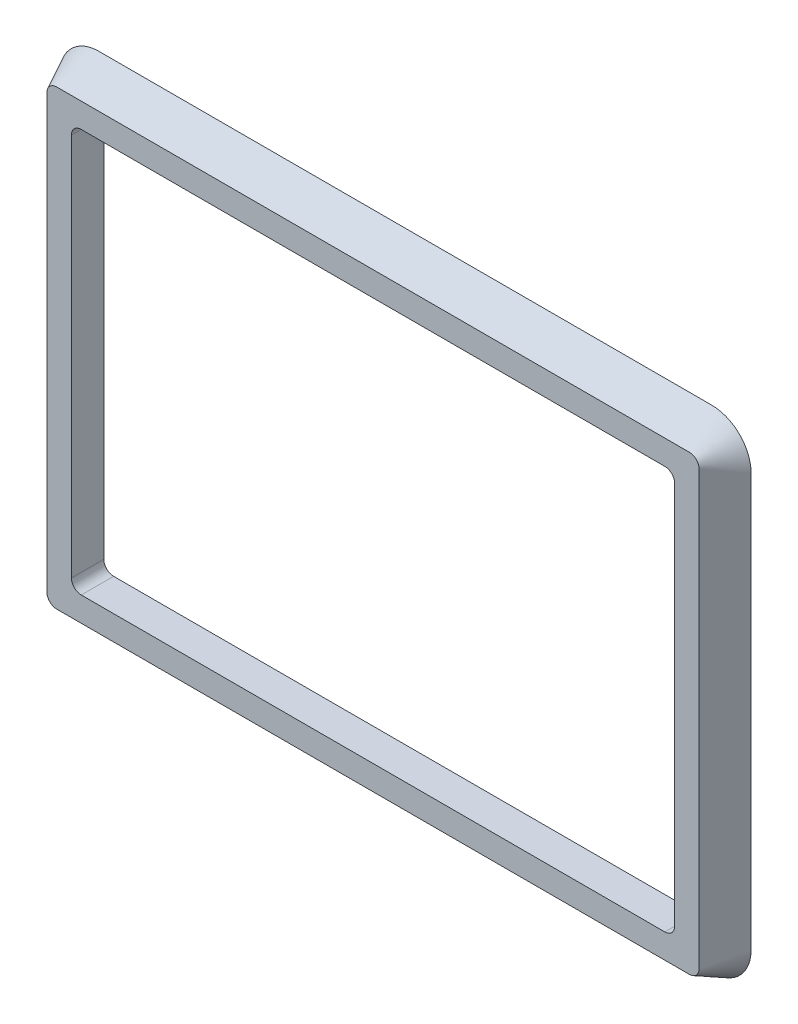
ISO-10303-21;
HEADER;
FILE_DESCRIPTION(('STEP AP214'),'2;1');
FILE_NAME('part.step','',(''),(''),'','','');
FILE_SCHEMA(('AUTOMOTIVE_DESIGN { 1 0 10303 214 1 1 1 1 }'));
ENDSEC;
DATA;
#1=APPLICATION_CONTEXT('core data for automotive mechanical design processes');
#2=APPLICATION_PROTOCOL_DEFINITION('international standard','automotive_design',2000,#1);
#3=PRODUCT_CONTEXT('',#1,'mechanical');
#4=PRODUCT('Part','Part','',(#3));
#5=PRODUCT_RELATED_PRODUCT_CATEGORY('part','',(#4));
#6=PRODUCT_DEFINITION_FORMATION('','',#4);
#7=PRODUCT_DEFINITION_CONTEXT('part definition',#1,'design');
#8=PRODUCT_DEFINITION('design','',#6,#7);
#9=PRODUCT_DEFINITION_SHAPE('','',#8);
#10=(LENGTH_UNIT() NAMED_UNIT(*) SI_UNIT(.MILLI.,.METRE.));
#11=(NAMED_UNIT(*) PLANE_ANGLE_UNIT() SI_UNIT($,.RADIAN.));
#12=(NAMED_UNIT(*) SI_UNIT($,.STERADIAN.) SOLID_ANGLE_UNIT());
#13=UNCERTAINTY_MEASURE_WITH_UNIT(LENGTH_MEASURE(1.E-05),#10,'distance_accuracy_value','');
#14=(GEOMETRIC_REPRESENTATION_CONTEXT(3) GLOBAL_UNCERTAINTY_ASSIGNED_CONTEXT((#13)) GLOBAL_UNIT_ASSIGNED_CONTEXT((#10,
#11,#12)) REPRESENTATION_CONTEXT('',''));
#15=CARTESIAN_POINT('',(0.,0.,0.));
#16=DIRECTION('',(0.,0.,1.));
#17=DIRECTION('',(1.,0.,0.));
#18=AXIS2_PLACEMENT_3D('',#15,#16,#17);
#19=CARTESIAN_POINT('',(-32.255,22.055,3.3));
#20=DIRECTION('',(0.,0.,-1.));
#21=DIRECTION('',(-1.,0.,0.));
#22=AXIS2_PLACEMENT_3D('',#19,#20,#21);
#23=PLANE('',#22);
#24=DIRECTION('',(-1.,0.,0.));
#25=VECTOR('',#24,1.);
#26=CARTESIAN_POINT('',(29.755,20.555,3.3));
#27=LINE('',#26,#25);
#28=CARTESIAN_POINT('',(29.755,20.555,3.3));
#29=VERTEX_POINT('',#28);
#30=CARTESIAN_POINT('',(-29.755,20.555,3.3));
#31=VERTEX_POINT('',#30);
#32=EDGE_CURVE('E351',#29,#31,#27,.T.);
#33=ORIENTED_EDGE('',*,*,#32,.F.);
#34=CARTESIAN_POINT('',(29.755,19.555,3.3));
#35=DIRECTION('',(0.,0.,1.));
#36=DIRECTION('',(-1.,0.,0.));
#37=AXIS2_PLACEMENT_3D('',#34,#35,#36);
#38=CIRCLE('',#37,1.);
#39=CARTESIAN_POINT('',(30.755,19.555,3.3));
#40=VERTEX_POINT('',#39);
#41=EDGE_CURVE('E241',#40,#29,#38,.T.);
#42=ORIENTED_EDGE('',*,*,#41,.F.);
#43=DIRECTION('',(0.,1.,0.));
#44=VECTOR('',#43,1.);
#45=CARTESIAN_POINT('',(30.755,-19.555,3.3));
#46=LINE('',#45,#44);
#47=CARTESIAN_POINT('',(30.755,-19.555,3.3));
#48=VERTEX_POINT('',#47);
#49=EDGE_CURVE('E372',#48,#40,#46,.T.);
#50=ORIENTED_EDGE('',*,*,#49,.F.);
#51=CARTESIAN_POINT('',(29.755,-19.555,3.3));
#52=DIRECTION('',(0.,0.,1.));
#53=DIRECTION('',(1.,0.,0.));
#54=AXIS2_PLACEMENT_3D('',#51,#52,#53);
#55=CIRCLE('',#54,1.);
#56=CARTESIAN_POINT('',(29.755,-20.555,3.3));
#57=VERTEX_POINT('',#56);
#58=EDGE_CURVE('E369',#57,#48,#55,.T.);
#59=ORIENTED_EDGE('',*,*,#58,.F.);
#60=DIRECTION('',(1.,0.,0.));
#61=VECTOR('',#60,1.);
#62=CARTESIAN_POINT('',(-29.755,-20.555,3.3));
#63=LINE('',#62,#61);
#64=CARTESIAN_POINT('',(-29.755,-20.555,3.3));
#65=VERTEX_POINT('',#64);
#66=EDGE_CURVE('E366',#65,#57,#63,.T.);
#67=ORIENTED_EDGE('',*,*,#66,.F.);
#68=CARTESIAN_POINT('',(-29.755,-19.555,3.3));
#69=DIRECTION('',(0.,0.,1.));
#70=DIRECTION('',(1.,0.,0.));
#71=AXIS2_PLACEMENT_3D('',#68,#69,#70);
#72=CIRCLE('',#71,1.);
#73=CARTESIAN_POINT('',(-30.755,-19.555,3.3));
#74=VERTEX_POINT('',#73);
#75=EDGE_CURVE('E360',#74,#65,#72,.T.);
#76=ORIENTED_EDGE('',*,*,#75,.F.);
#77=DIRECTION('',(0.,-1.,0.));
#78=VECTOR('',#77,1.);
#79=CARTESIAN_POINT('',(-30.755,19.555,3.3));
#80=LINE('',#79,#78);
#81=CARTESIAN_POINT('',(-30.755,19.555,3.3));
#82=VERTEX_POINT('',#81);
#83=EDGE_CURVE('E358',#82,#74,#80,.T.);
#84=ORIENTED_EDGE('',*,*,#83,.F.);
#85=CARTESIAN_POINT('',(-29.755,19.555,3.3));
#86=DIRECTION('',(0.,0.,1.));
#87=DIRECTION('',(1.,0.,0.));
#88=AXIS2_PLACEMENT_3D('',#85,#86,#87);
#89=CIRCLE('',#88,1.);
#90=EDGE_CURVE('E342',#31,#82,#89,.T.);
#91=ORIENTED_EDGE('',*,*,#90,.F.);
#92=EDGE_LOOP('',(#33,#42,#50,#59,#67,#76,#84,#91));
#93=FACE_BOUND('',#92,.T.);
#94=CARTESIAN_POINT('',(-32.255,22.055,3.3));
#95=DIRECTION('',(0.,0.,1.));
#96=DIRECTION('',(-1.,0.,0.));
#97=AXIS2_PLACEMENT_3D('',#94,#95,#96);
#98=CIRCLE('',#97,1.);
#99=CARTESIAN_POINT('',(-32.255,23.055,3.3));
#100=VERTEX_POINT('',#99);
#101=CARTESIAN_POINT('',(-33.255,22.055,3.3));
#102=VERTEX_POINT('',#101);
#103=EDGE_CURVE('E377',#100,#102,#98,.T.);
#104=ORIENTED_EDGE('',*,*,#103,.T.);
#105=DIRECTION('',(0.,-1.,0.));
#106=VECTOR('',#105,1.);
#107=CARTESIAN_POINT('',(-33.255,-22.055,3.3));
#108=LINE('',#107,#106);
#109=CARTESIAN_POINT('',(-33.255,-22.055,3.3));
#110=VERTEX_POINT('',#109);
#111=EDGE_CURVE('E592',#102,#110,#108,.T.);
#112=ORIENTED_EDGE('',*,*,#111,.T.);
#113=CARTESIAN_POINT('',(-32.255,-22.055,3.3));
#114=DIRECTION('',(0.,0.,1.));
#115=DIRECTION('',(-1.,0.,0.));
#116=AXIS2_PLACEMENT_3D('',#113,#114,#115);
#117=CIRCLE('',#116,1.);
#118=CARTESIAN_POINT('',(-32.255,-23.055,3.3));
#119=VERTEX_POINT('',#118);
#120=EDGE_CURVE('E595',#110,#119,#117,.T.);
#121=ORIENTED_EDGE('',*,*,#120,.T.);
#122=DIRECTION('',(1.,0.,0.));
#123=VECTOR('',#122,1.);
#124=CARTESIAN_POINT('',(-32.255,-23.055,3.3));
#125=LINE('',#124,#123);
#126=CARTESIAN_POINT('',(32.255,-23.055,3.3));
#127=VERTEX_POINT('',#126);
#128=EDGE_CURVE('E613',#119,#127,#125,.T.);
#129=ORIENTED_EDGE('',*,*,#128,.T.);
#130=CARTESIAN_POINT('',(32.255,-22.055,3.3));
#131=DIRECTION('',(0.,0.,1.));
#132=DIRECTION('',(1.,0.,0.));
#133=AXIS2_PLACEMENT_3D('',#130,#131,#132);
#134=CIRCLE('',#133,1.);
#135=CARTESIAN_POINT('',(33.255,-22.055,3.3));
#136=VERTEX_POINT('',#135);
#137=EDGE_CURVE('E616',#127,#136,#134,.T.);
#138=ORIENTED_EDGE('',*,*,#137,.T.);
#139=DIRECTION('',(0.,1.,0.));
#140=VECTOR('',#139,1.);
#141=CARTESIAN_POINT('',(33.255,-22.055,3.3));
#142=LINE('',#141,#140);
#143=CARTESIAN_POINT('',(33.255,22.055,3.3));
#144=VERTEX_POINT('',#143);
#145=EDGE_CURVE('E634',#136,#144,#142,.T.);
#146=ORIENTED_EDGE('',*,*,#145,.T.);
#147=CARTESIAN_POINT('',(32.255,22.055,3.3));
#148=DIRECTION('',(0.,0.,1.));
#149=DIRECTION('',(-1.,0.,0.));
#150=AXIS2_PLACEMENT_3D('',#147,#148,#149);
#151=CIRCLE('',#150,1.);
#152=CARTESIAN_POINT('',(32.255,23.055,3.3));
#153=VERTEX_POINT('',#152);
#154=EDGE_CURVE('E637',#144,#153,#151,.T.);
#155=ORIENTED_EDGE('',*,*,#154,.T.);
#156=DIRECTION('',(-1.,0.,0.));
#157=VECTOR('',#156,1.);
#158=CARTESIAN_POINT('',(-32.255,23.055,3.3));
#159=LINE('',#158,#157);
#160=EDGE_CURVE('E654',#153,#100,#159,.T.);
#161=ORIENTED_EDGE('',*,*,#160,.T.);
#162=EDGE_LOOP('',(#104,#112,#121,#129,#138,#146,#155,#161));
#163=FACE_BOUND('',#162,.T.);
#164=ADVANCED_FACE('F226',(#93,#163),#23,.F.);
#165=CARTESIAN_POINT('',(31.25,-21.055,0.));
#166=DIRECTION('',(0.,0.,1.));
#167=DIRECTION('',(1.,0.,0.));
#168=AXIS2_PLACEMENT_3D('',#165,#166,#167);
#169=PLANE('',#168);
#170=DIRECTION('',(0.,1.,0.));
#171=VECTOR('',#170,1.);
#172=CARTESIAN_POINT('',(30.755,-21.055,0.));
#173=LINE('',#172,#171);
#174=CARTESIAN_POINT('',(30.755,-19.555,0.));
#175=VERTEX_POINT('',#174);
#176=CARTESIAN_POINT('',(30.755,19.555,0.));
#177=VERTEX_POINT('',#176);
#178=EDGE_CURVE('E234',#175,#177,#173,.T.);
#179=ORIENTED_EDGE('',*,*,#178,.T.);
#180=CARTESIAN_POINT('',(29.755,19.555,0.));
#181=DIRECTION('',(0.,0.,1.));
#182=DIRECTION('',(1.,0.,0.));
#183=AXIS2_PLACEMENT_3D('',#180,#181,#182);
#184=CIRCLE('',#183,1.);
#185=CARTESIAN_POINT('',(29.755,20.555,0.));
#186=VERTEX_POINT('',#185);
#187=EDGE_CURVE('E12',#177,#186,#184,.T.);
#188=ORIENTED_EDGE('',*,*,#187,.T.);
#189=DIRECTION('',(-1.,0.,0.));
#190=VECTOR('',#189,1.);
#191=CARTESIAN_POINT('',(31.25,20.555,0.));
#192=LINE('',#191,#190);
#193=CARTESIAN_POINT('',(-29.755,20.555,0.));
#194=VERTEX_POINT('',#193);
#195=EDGE_CURVE('E513',#186,#194,#192,.T.);
#196=ORIENTED_EDGE('',*,*,#195,.T.);
#197=CARTESIAN_POINT('',(-29.755,19.555,0.));
#198=DIRECTION('',(0.,0.,1.));
#199=DIRECTION('',(1.,0.,0.));
#200=AXIS2_PLACEMENT_3D('',#197,#198,#199);
#201=CIRCLE('',#200,1.);
#202=CARTESIAN_POINT('',(-30.755,19.555,0.));
#203=VERTEX_POINT('',#202);
#204=EDGE_CURVE('E345',#194,#203,#201,.T.);
#205=ORIENTED_EDGE('',*,*,#204,.T.);
#206=DIRECTION('',(0.,-1.,0.));
#207=VECTOR('',#206,1.);
#208=CARTESIAN_POINT('',(-30.755,-21.055,0.));
#209=LINE('',#208,#207);
#210=CARTESIAN_POINT('',(-30.755,-19.555,0.));
#211=VERTEX_POINT('',#210);
#212=EDGE_CURVE('E670',#203,#211,#209,.T.);
#213=ORIENTED_EDGE('',*,*,#212,.T.);
#214=CARTESIAN_POINT('',(-29.755,-19.555,0.));
#215=DIRECTION('',(0.,0.,1.));
#216=DIRECTION('',(1.,0.,0.));
#217=AXIS2_PLACEMENT_3D('',#214,#215,#216);
#218=CIRCLE('',#217,1.);
#219=CARTESIAN_POINT('',(-29.755,-20.555,0.));
#220=VERTEX_POINT('',#219);
#221=EDGE_CURVE('E673',#211,#220,#218,.T.);
#222=ORIENTED_EDGE('',*,*,#221,.T.);
#223=DIRECTION('',(1.,0.,0.));
#224=VECTOR('',#223,1.);
#225=CARTESIAN_POINT('',(31.25,-20.555,0.));
#226=LINE('',#225,#224);
#227=CARTESIAN_POINT('',(29.755,-20.555,0.));
#228=VERTEX_POINT('',#227);
#229=EDGE_CURVE('E676',#220,#228,#226,.T.);
#230=ORIENTED_EDGE('',*,*,#229,.T.);
#231=CARTESIAN_POINT('',(29.755,-19.555,0.));
#232=DIRECTION('',(0.,0.,1.));
#233=DIRECTION('',(1.,0.,0.));
#234=AXIS2_PLACEMENT_3D('',#231,#232,#233);
#235=CIRCLE('',#234,1.);
#236=EDGE_CURVE('E679',#228,#175,#235,.T.);
#237=ORIENTED_EDGE('',*,*,#236,.T.);
#238=EDGE_LOOP('',(#179,#188,#196,#205,#213,#222,#230,#237));
#239=FACE_BOUND('',#238,.T.);
#240=CARTESIAN_POINT('',(31.25,-21.055,0.));
#241=DIRECTION('',(0.,0.,1.));
#242=DIRECTION('',(1.,0.,0.));
#243=AXIS2_PLACEMENT_3D('',#240,#241,#242);
#244=CIRCLE('',#243,4.);
#245=CARTESIAN_POINT('',(31.25,-25.055,0.));
#246=VERTEX_POINT('',#245);
#247=CARTESIAN_POINT('',(35.25,-21.055,0.));
#248=VERTEX_POINT('',#247);
#249=EDGE_CURVE('E508',#246,#248,#244,.T.);
#250=ORIENTED_EDGE('',*,*,#249,.F.);
#251=DIRECTION('',(1.,0.,0.));
#252=VECTOR('',#251,1.);
#253=CARTESIAN_POINT('',(-31.25,-25.055,0.));
#254=LINE('',#253,#252);
#255=CARTESIAN_POINT('',(-31.25,-25.055,0.));
#256=VERTEX_POINT('',#255);
#257=EDGE_CURVE('E392',#256,#246,#254,.T.);
#258=ORIENTED_EDGE('',*,*,#257,.F.);
#259=CARTESIAN_POINT('',(-31.25,-21.055,0.));
#260=DIRECTION('',(0.,0.,1.));
#261=DIRECTION('',(-1.,0.,0.));
#262=AXIS2_PLACEMENT_3D('',#259,#260,#261);
#263=CIRCLE('',#262,4.);
#264=CARTESIAN_POINT('',(-35.25,-21.055,0.));
#265=VERTEX_POINT('',#264);
#266=EDGE_CURVE('E514',#265,#256,#263,.T.);
#267=ORIENTED_EDGE('',*,*,#266,.F.);
#268=DIRECTION('',(0.,-1.,0.));
#269=VECTOR('',#268,1.);
#270=CARTESIAN_POINT('',(-35.25,-21.055,0.));
#271=LINE('',#270,#269);
#272=CARTESIAN_POINT('',(-35.25,21.055,0.));
#273=VERTEX_POINT('',#272);
#274=EDGE_CURVE('E532',#273,#265,#271,.T.);
#275=ORIENTED_EDGE('',*,*,#274,.F.);
#276=CARTESIAN_POINT('',(-31.25,21.055,0.));
#277=DIRECTION('',(0.,0.,1.));
#278=DIRECTION('',(-1.,0.,0.));
#279=AXIS2_PLACEMENT_3D('',#276,#277,#278);
#280=CIRCLE('',#279,4.);
#281=CARTESIAN_POINT('',(-31.25,25.055,0.));
#282=VERTEX_POINT('',#281);
#283=EDGE_CURVE('E535',#282,#273,#280,.T.);
#284=ORIENTED_EDGE('',*,*,#283,.F.);
#285=DIRECTION('',(-1.,0.,0.));
#286=VECTOR('',#285,1.);
#287=CARTESIAN_POINT('',(-31.25,25.055,0.));
#288=LINE('',#287,#286);
#289=CARTESIAN_POINT('',(31.25,25.055,0.));
#290=VERTEX_POINT('',#289);
#291=EDGE_CURVE('E553',#290,#282,#288,.T.);
#292=ORIENTED_EDGE('',*,*,#291,.F.);
#293=CARTESIAN_POINT('',(31.25,21.055,0.));
#294=DIRECTION('',(0.,0.,1.));
#295=DIRECTION('',(-1.,0.,0.));
#296=AXIS2_PLACEMENT_3D('',#293,#294,#295);
#297=CIRCLE('',#296,4.);
#298=CARTESIAN_POINT('',(35.25,21.055,0.));
#299=VERTEX_POINT('',#298);
#300=EDGE_CURVE('E556',#299,#290,#297,.T.);
#301=ORIENTED_EDGE('',*,*,#300,.F.);
#302=DIRECTION('',(0.,1.,0.));
#303=VECTOR('',#302,1.);
#304=CARTESIAN_POINT('',(35.25,-21.055,0.));
#305=LINE('',#304,#303);
#306=EDGE_CURVE('E574',#248,#299,#305,.T.);
#307=ORIENTED_EDGE('',*,*,#306,.F.);
#308=EDGE_LOOP('',(#250,#258,#267,#275,#284,#292,#301,#307));
#309=FACE_BOUND('',#308,.T.);
#310=ADVANCED_FACE('F410',(#239,#309),#169,.F.);
#311=CARTESIAN_POINT('',(35.25,21.0549999994716,0.));
#312=CARTESIAN_POINT('',(33.255,22.0549999995012,3.3));
#313=CARTESIAN_POINT('',(33.2548910613206,22.0550546053555,3.30018019931927));
#314=CARTESIAN_POINT('',(35.25,21.1380333099801,0.));
#315=CARTESIAN_POINT('',(33.255,22.1333793771264,3.3));
#316=CARTESIAN_POINT('',(33.2548910613206,22.1334337288488,3.30018019931927));
#317=CARTESIAN_POINT('',(35.2450740401068,21.3129727486955,0.));
#318=CARTESIAN_POINT('',(33.2420402399805,22.2229177651005,3.3));
#319=CARTESIAN_POINT('',(33.2419308626086,22.2229674534255,3.30018019931927));
#320=CARTESIAN_POINT('',(35.2149616165085,21.6110370684901,0.));
#321=CARTESIAN_POINT('',(33.2166572008428,22.3390530192757,3.3));
#322=CARTESIAN_POINT('',(33.2165480817229,22.3390927732087,3.30018019931927));
#323=CARTESIAN_POINT('',(35.1541801050728,21.9537932554618,0.));
#324=CARTESIAN_POINT('',(33.1838856390283,22.4274118129235,3.3));
#325=CARTESIAN_POINT('',(33.1837780494157,22.4274376752695,3.30018019931927));
#326=CARTESIAN_POINT('',(35.0477719173209,22.3357039683169,0.));
#327=CARTESIAN_POINT('',(33.1475829170302,22.5094420045234,3.3));
#328=CARTESIAN_POINT('',(33.1474791555865,22.5094514916373,3.30018019931927));
#329=CARTESIAN_POINT('',(34.8807794647742,22.7512318657617,0.));
#330=CARTESIAN_POINT('',(33.1068510264534,22.5803547468844,3.3));
#331=CARTESIAN_POINT('',(33.1067541595755,22.5803454159933,3.30018019931927));
#332=CARTESIAN_POINT('',(34.6596292666324,23.1663627219293,0.));
#333=CARTESIAN_POINT('',(33.0627604572817,22.6464936286021,3.3));
#334=CARTESIAN_POINT('',(33.0626732588961,22.6464652407062,3.30018019931927));
#335=CARTESIAN_POINT('',(34.3907478420953,23.547082310953,0.));
#336=CARTESIAN_POINT('',(33.0147858782825,22.7064913724488,3.3));
#337=CARTESIAN_POINT('',(33.0147107427039,22.7064454712625,3.30018019931927));
#338=CARTESIAN_POINT('',(34.0800576063056,23.8927048968527,0.));
#339=CARTESIAN_POINT('',(32.9632487369511,22.7624584976147,3.30000000000001));
#340=CARTESIAN_POINT('',(32.9631877526486,22.7623967795445,3.30018019931927));
#341=CARTESIAN_POINT('',(33.7334809744059,24.2025447436482,0.));
#342=CARTESIAN_POINT('',(32.9073306796916,22.8140626766366,3.29999999999999));
#343=CARTESIAN_POINT('',(32.907285567049,22.8139868573871,3.30018019931926));
#344=CARTESIAN_POINT('',(33.3519585421631,24.4704557644377,0.));
#345=CARTESIAN_POINT('',(32.8473897746949,22.8621102270252,3.30000000000001));
#346=CARTESIAN_POINT('',(32.8473622222863,22.862022401943,3.30018019931928));
#347=CARTESIAN_POINT('',(32.9364309053437,24.6902918723194,0.));
#348=CARTESIAN_POINT('',(32.7812614369247,22.9062811480817,3.29999999999999));
#349=CARTESIAN_POINT('',(32.7812529637633,22.906183730652,3.30018019931926));
#350=CARTESIAN_POINT('',(32.5214400504139,24.8558205036737,0.));
#351=CARTESIAN_POINT('',(32.7104061068242,22.9471097880587,3.30000000000001));
#352=CARTESIAN_POINT('',(32.7104164254772,22.9470055612794,3.30018019931928));
#353=CARTESIAN_POINT('',(32.1415279638394,24.9608090948807,0.));
#354=CARTESIAN_POINT('',(32.6282969190666,22.9835063601379,3.29999999999999));
#355=CARTESIAN_POINT('',(32.6283234995013,22.9833983878328,3.30018019931926));
#356=CARTESIAN_POINT('',(31.8013967239928,25.0204990858531,0.));
#357=CARTESIAN_POINT('',(32.5400235760803,23.0164110305599,3.30000000000001));
#358=CARTESIAN_POINT('',(32.5400639094306,23.0163015956195,3.30018019931927));
#359=CARTESIAN_POINT('',(31.5057484092465,25.0501319165035,0.));
#360=CARTESIAN_POINT('',(32.423523405877,23.0418961582726,3.3));
#361=CARTESIAN_POINT('',(32.4235735217647,23.0417864968433,3.30018019931927));
#362=CARTESIAN_POINT('',(31.3323063959239,25.055,0.));
#363=CARTESIAN_POINT('',(32.334072700125,23.055,3.3));
#364=CARTESIAN_POINT('',(32.3341274024299,23.0548907882914,3.30018019931927));
#365=CARTESIAN_POINT('',(25.8472934769061,25.055,0.));
#366=CARTESIAN_POINT('',(27.0645577753253,23.055,3.3));
#367=CARTESIAN_POINT('',(27.0646242450822,23.0548907882913,3.30018019931927));
#368=CARTESIAN_POINT('',(15.3489403943726,25.055,0.));
#369=CARTESIAN_POINT('',(16.4203076439289,23.055,3.3));
#370=CARTESIAN_POINT('',(16.4203661468528,23.0548907882913,3.30018019931927));
#371=CARTESIAN_POINT('',(0.,25.055,0.));
#372=CARTESIAN_POINT('',(0.,23.055,3.3));
#373=CARTESIAN_POINT('',(0.,23.0548907882914,3.30018019931926));
#374=CARTESIAN_POINT('',(-15.3489403943726,25.055,0.));
#375=CARTESIAN_POINT('',(-16.4203076439289,23.055,3.3));
#376=CARTESIAN_POINT('',(-16.4203661468528,23.0548907882913,3.30018019931927));
#377=CARTESIAN_POINT('',(-25.8472934769061,25.055,0.));
#378=CARTESIAN_POINT('',(-27.0645577753253,23.055,3.3));
#379=CARTESIAN_POINT('',(-27.0646242450822,23.0548907882913,3.30018019931927));
#380=CARTESIAN_POINT('',(-31.3323063959239,25.055,0.));
#381=CARTESIAN_POINT('',(-32.334072700125,23.055,3.3));
#382=CARTESIAN_POINT('',(-32.3341274024299,23.0548907882914,3.30018019931927));
#383=CARTESIAN_POINT('',(-31.5057484092465,25.0501319165035,0.));
#384=CARTESIAN_POINT('',(-32.423523405877,23.0418961582726,3.3));
#385=CARTESIAN_POINT('',(-32.4235735217648,23.0417864968433,3.30018019931927));
#386=CARTESIAN_POINT('',(-31.8013967239927,25.0204990858531,0.));
#387=CARTESIAN_POINT('',(-32.5400235760802,23.0164110305599,3.3));
#388=CARTESIAN_POINT('',(-32.5400639094305,23.0163015956195,3.30018019931927));
#389=CARTESIAN_POINT('',(-32.1415279638394,24.9608090948807,0.));
#390=CARTESIAN_POINT('',(-32.6282969190666,22.9835063601379,3.3));
#391=CARTESIAN_POINT('',(-32.6283234995013,22.9833983878328,3.30018019931927));
#392=CARTESIAN_POINT('',(-32.5214400504139,24.8558205036737,0.));
#393=CARTESIAN_POINT('',(-32.7104061068243,22.9471097880587,3.3));
#394=CARTESIAN_POINT('',(-32.7104164254772,22.9470055612794,3.30018019931927));
#395=CARTESIAN_POINT('',(-32.9364309053438,24.6902918723194,0.));
#396=CARTESIAN_POINT('',(-32.7812614369247,22.9062811480817,3.3));
#397=CARTESIAN_POINT('',(-32.7812529637633,22.906183730652,3.30018019931927));
#398=CARTESIAN_POINT('',(-33.3519585421631,24.4704557644377,0.));
#399=CARTESIAN_POINT('',(-32.8473897746949,22.8621102270251,3.3));
#400=CARTESIAN_POINT('',(-32.8473622222863,22.862022401943,3.30018019931927));
#401=CARTESIAN_POINT('',(-33.733480974406,24.2025447436482,0.));
#402=CARTESIAN_POINT('',(-32.9073306796916,22.8140626766366,3.3));
#403=CARTESIAN_POINT('',(-32.907285567049,22.8139868573871,3.30018019931927));
#404=CARTESIAN_POINT('',(-34.0800576063056,23.8927048968527,0.));
#405=CARTESIAN_POINT('',(-32.9632487369511,22.7624584976147,3.3));
#406=CARTESIAN_POINT('',(-32.9631877526486,22.7623967795445,3.30018019931927));
#407=CARTESIAN_POINT('',(-34.3907478420953,23.547082310953,0.));
#408=CARTESIAN_POINT('',(-33.0147858782824,22.7064913724488,3.29999999999999));
#409=CARTESIAN_POINT('',(-33.0147107427039,22.7064454712624,3.30018019931926));
#410=CARTESIAN_POINT('',(-34.6596292666324,23.1663627219293,0.));
#411=CARTESIAN_POINT('',(-33.0627604572817,22.6464936286022,3.30000000000001));
#412=CARTESIAN_POINT('',(-33.0626732588961,22.6464652407062,3.30018019931927));
#413=CARTESIAN_POINT('',(-34.8807794647742,22.7512318657617,0.));
#414=CARTESIAN_POINT('',(-33.1068510264534,22.5803547468844,3.3));
#415=CARTESIAN_POINT('',(-33.1067541595755,22.5803454159933,3.30018019931926));
#416=CARTESIAN_POINT('',(-35.0477719173209,22.3357039683169,0.));
#417=CARTESIAN_POINT('',(-33.1475829170302,22.5094420045233,3.3));
#418=CARTESIAN_POINT('',(-33.1474791555864,22.5094514916372,3.30018019931927));
#419=CARTESIAN_POINT('',(-35.1541801050728,21.9537932554618,0.));
#420=CARTESIAN_POINT('',(-33.1838856390284,22.4274118129236,3.3));
#421=CARTESIAN_POINT('',(-33.1837780494158,22.4274376752695,3.30018019931927));
#422=CARTESIAN_POINT('',(-35.2149616165085,21.6110370684901,0.));
#423=CARTESIAN_POINT('',(-33.2166572008427,22.3390530192757,3.3));
#424=CARTESIAN_POINT('',(-33.2165480817229,22.3390927732086,3.30018019931927));
#425=CARTESIAN_POINT('',(-35.2450740401068,21.3129727486955,0.));
#426=CARTESIAN_POINT('',(-33.2420402399805,22.2229177651005,3.3));
#427=CARTESIAN_POINT('',(-33.2419308626086,22.2229674534255,3.30018019931927));
#428=CARTESIAN_POINT('',(-35.25,21.1380333099801,0.));
#429=CARTESIAN_POINT('',(-33.255,22.1333793771264,3.3));
#430=CARTESIAN_POINT('',(-33.2548910613206,22.1334337288488,3.30018019931927));
#431=CARTESIAN_POINT('',(-35.25,17.3543677998165,0.));
#432=CARTESIAN_POINT('',(-33.255,18.5617844833128,3.3));
#433=CARTESIAN_POINT('',(-33.2548910613206,18.5618504153323,3.30018019931927));
#434=CARTESIAN_POINT('',(-35.2500000000001,10.2622451288133,0.));
#435=CARTESIAN_POINT('',(-33.255,11.3226655772709,3.3));
#436=CARTESIAN_POINT('',(-33.2548910613207,11.3227234824354,3.30018019931927));
#437=CARTESIAN_POINT('',(-35.2499999999999,0.,0.));
#438=CARTESIAN_POINT('',(-33.2549999999999,0.,3.3));
#439=CARTESIAN_POINT('',(-33.2548910613206,0.,3.30018019931927));
#440=CARTESIAN_POINT('',(-35.25,-10.2622451288133,0.));
#441=CARTESIAN_POINT('',(-33.255,-11.3226655772708,3.3));
#442=CARTESIAN_POINT('',(-33.2548910613207,-11.3227234824354,3.30018019931927));
#443=CARTESIAN_POINT('',(-35.25,-17.3543677998165,0.));
#444=CARTESIAN_POINT('',(-33.255,-18.5617844833128,3.3));
#445=CARTESIAN_POINT('',(-33.2548910613206,-18.5618504153323,3.30018019931927));
#446=CARTESIAN_POINT('',(-35.25,-21.1380333099801,0.));
#447=CARTESIAN_POINT('',(-33.255,-22.1333793771264,3.3));
#448=CARTESIAN_POINT('',(-33.2548910613206,-22.1334337288488,3.30018019931927));
#449=CARTESIAN_POINT('',(-35.2450740401068,-21.3129727486956,0.));
#450=CARTESIAN_POINT('',(-33.2420402399805,-22.2229177651005,3.3));
#451=CARTESIAN_POINT('',(-33.2419308626086,-22.2229674534255,3.30018019931927));
#452=CARTESIAN_POINT('',(-35.2149616165085,-21.6110370684901,0.));
#453=CARTESIAN_POINT('',(-33.2166572008428,-22.3390530192757,3.29999999999999));
#454=CARTESIAN_POINT('',(-33.2165480817229,-22.3390927732087,3.30018019931926));
#455=CARTESIAN_POINT('',(-35.1541801050728,-21.9537932554618,0.));
#456=CARTESIAN_POINT('',(-33.1838856390283,-22.4274118129236,3.30000000000001));
#457=CARTESIAN_POINT('',(-33.1837780494157,-22.4274376752695,3.30018019931928));
#458=CARTESIAN_POINT('',(-35.0477719173209,-22.3357039683169,0.));
#459=CARTESIAN_POINT('',(-33.1475829170302,-22.5094420045233,3.29999999999999));
#460=CARTESIAN_POINT('',(-33.1474791555865,-22.5094514916372,3.30018019931926));
#461=CARTESIAN_POINT('',(-34.8807794647742,-22.7512318657617,0.));
#462=CARTESIAN_POINT('',(-33.1068510264533,-22.5803547468844,3.3));
#463=CARTESIAN_POINT('',(-33.1067541595754,-22.5803454159933,3.30018019931927));
#464=CARTESIAN_POINT('',(-34.6596292666324,-23.1663627219293,0.));
#465=CARTESIAN_POINT('',(-33.0627604572818,-22.6464936286021,3.3));
#466=CARTESIAN_POINT('',(-33.0626732588962,-22.6464652407061,3.30018019931927));
#467=CARTESIAN_POINT('',(-34.3907478420953,-23.547082310953,0.));
#468=CARTESIAN_POINT('',(-33.0147858782824,-22.7064913724488,3.3));
#469=CARTESIAN_POINT('',(-33.0147107427039,-22.7064454712625,3.30018019931927));
#470=CARTESIAN_POINT('',(-34.0800576063056,-23.8927048968527,0.));
#471=CARTESIAN_POINT('',(-32.9632487369511,-22.7624584976147,3.3));
#472=CARTESIAN_POINT('',(-32.9631877526486,-22.7623967795445,3.30018019931927));
#473=CARTESIAN_POINT('',(-33.7334809744059,-24.2025447436482,0.));
#474=CARTESIAN_POINT('',(-32.9073306796916,-22.8140626766366,3.3));
#475=CARTESIAN_POINT('',(-32.9072855670489,-22.8139868573871,3.30018019931927));
#476=CARTESIAN_POINT('',(-33.351958542163,-24.4704557644377,0.));
#477=CARTESIAN_POINT('',(-32.8473897746949,-22.8621102270251,3.29999999999999));
#478=CARTESIAN_POINT('',(-32.8473622222863,-22.862022401943,3.30018019931926));
#479=CARTESIAN_POINT('',(-32.9364309053437,-24.6902918723195,0.));
#480=CARTESIAN_POINT('',(-32.7812614369246,-22.9062811480817,3.30000000000001));
#481=CARTESIAN_POINT('',(-32.7812529637633,-22.906183730652,3.30018019931928));
#482=CARTESIAN_POINT('',(-32.5214400504138,-24.8558205036737,0.));
#483=CARTESIAN_POINT('',(-32.7104061068243,-22.9471097880587,3.29999999999999));
#484=CARTESIAN_POINT('',(-32.7104164254772,-22.9470055612794,3.30018019931926));
#485=CARTESIAN_POINT('',(-32.1415279638393,-24.9608090948807,0.));
#486=CARTESIAN_POINT('',(-32.6282969190666,-22.9835063601379,3.30000000000001));
#487=CARTESIAN_POINT('',(-32.6283234995013,-22.9833983878328,3.30018019931928));
#488=CARTESIAN_POINT('',(-31.8013967239927,-25.0204990858531,0.));
#489=CARTESIAN_POINT('',(-32.5400235760802,-23.0164110305599,3.29999999999999));
#490=CARTESIAN_POINT('',(-32.5400639094305,-23.0163015956195,3.30018019931926));
#491=CARTESIAN_POINT('',(-31.5057484092465,-25.0501319165035,0.));
#492=CARTESIAN_POINT('',(-32.423523405877,-23.0418961582726,3.3));
#493=CARTESIAN_POINT('',(-32.4235735217648,-23.0417864968433,3.30018019931927));
#494=CARTESIAN_POINT('',(-31.3323063959239,-25.055,0.));
#495=CARTESIAN_POINT('',(-32.334072700125,-23.055,3.3));
#496=CARTESIAN_POINT('',(-32.3341274024299,-23.0548907882913,3.30018019931927));
#497=CARTESIAN_POINT('',(-25.8472934769061,-25.055,0.));
#498=CARTESIAN_POINT('',(-27.0645577753253,-23.055,3.3));
#499=CARTESIAN_POINT('',(-27.0646242450822,-23.0548907882913,3.30018019931927));
#500=CARTESIAN_POINT('',(-15.3489403943726,-25.055,0.));
#501=CARTESIAN_POINT('',(-16.4203076439289,-23.055,3.3));
#502=CARTESIAN_POINT('',(-16.4203661468528,-23.0548907882913,3.30018019931927));
#503=CARTESIAN_POINT('',(0.,-25.055,0.));
#504=CARTESIAN_POINT('',(0.,-23.055,3.3));
#505=CARTESIAN_POINT('',(0.,-23.0548907882914,3.30018019931927));
#506=CARTESIAN_POINT('',(15.3489403943726,-25.055,0.));
#507=CARTESIAN_POINT('',(16.4203076439289,-23.055,3.3));
#508=CARTESIAN_POINT('',(16.4203661468528,-23.0548907882913,3.30018019931927));
#509=CARTESIAN_POINT('',(25.8472934769061,-25.055,0.));
#510=CARTESIAN_POINT('',(27.0645577753253,-23.055,3.3));
#511=CARTESIAN_POINT('',(27.0646242450822,-23.0548907882913,3.30018019931927));
#512=CARTESIAN_POINT('',(31.3323063959239,-25.055,0.));
#513=CARTESIAN_POINT('',(32.334072700125,-23.055,3.3));
#514=CARTESIAN_POINT('',(32.3341274024299,-23.0548907882913,3.30018019931927));
#515=CARTESIAN_POINT('',(31.5057484092465,-25.0501319165035,0.));
#516=CARTESIAN_POINT('',(32.423523405877,-23.0418961582726,3.3));
#517=CARTESIAN_POINT('',(32.4235735217648,-23.0417864968433,3.30018019931927));
#518=CARTESIAN_POINT('',(31.8013967239927,-25.0204990858531,0.));
#519=CARTESIAN_POINT('',(32.5400235760802,-23.0164110305598,3.3));
#520=CARTESIAN_POINT('',(32.5400639094305,-23.0163015956194,3.30018019931927));
#521=CARTESIAN_POINT('',(32.1415279638394,-24.9608090948807,0.));
#522=CARTESIAN_POINT('',(32.6282969190667,-22.9835063601379,3.3));
#523=CARTESIAN_POINT('',(32.6283234995013,-22.9833983878328,3.30018019931927));
#524=CARTESIAN_POINT('',(32.5214400504139,-24.8558205036737,0.));
#525=CARTESIAN_POINT('',(32.7104061068242,-22.9471097880586,3.3));
#526=CARTESIAN_POINT('',(32.7104164254772,-22.9470055612794,3.30018019931927));
#527=CARTESIAN_POINT('',(32.9364309053437,-24.6902918723195,0.));
#528=CARTESIAN_POINT('',(32.7812614369246,-22.9062811480817,3.3));
#529=CARTESIAN_POINT('',(32.7812529637633,-22.906183730652,3.30018019931927));
#530=CARTESIAN_POINT('',(33.3519585421631,-24.4704557644377,0.));
#531=CARTESIAN_POINT('',(32.8473897746949,-22.8621102270251,3.3));
#532=CARTESIAN_POINT('',(32.8473622222863,-22.862022401943,3.30018019931927));
#533=CARTESIAN_POINT('',(33.7334809744059,-24.2025447436482,0.));
#534=CARTESIAN_POINT('',(32.9073306796916,-22.8140626766366,3.3));
#535=CARTESIAN_POINT('',(32.907285567049,-22.8139868573871,3.30018019931927));
#536=CARTESIAN_POINT('',(34.0800576063056,-23.8927048968526,0.));
#537=CARTESIAN_POINT('',(32.9632487369511,-22.7624584976147,3.3));
#538=CARTESIAN_POINT('',(32.9631877526487,-22.7623967795445,3.30018019931927));
#539=CARTESIAN_POINT('',(34.3907478420954,-23.5470823109529,0.));
#540=CARTESIAN_POINT('',(33.0147858782824,-22.7064913724488,3.3));
#541=CARTESIAN_POINT('',(33.0147107427038,-22.7064454712624,3.30018019931927));
#542=CARTESIAN_POINT('',(34.6596292666325,-23.1663627219292,0.));
#543=CARTESIAN_POINT('',(33.0627604572818,-22.6464936286021,3.3));
#544=CARTESIAN_POINT('',(33.0626732588962,-22.6464652407062,3.30018019931927));
#545=CARTESIAN_POINT('',(34.8807794647742,-22.7512318657616,0.));
#546=CARTESIAN_POINT('',(33.1068510264533,-22.5803547468843,3.3));
#547=CARTESIAN_POINT('',(33.1067541595754,-22.5803454159933,3.30018019931927));
#548=CARTESIAN_POINT('',(35.0477719173209,-22.3357039683168,0.));
#549=CARTESIAN_POINT('',(33.1475829170303,-22.5094420045234,3.3));
#550=CARTESIAN_POINT('',(33.1474791555865,-22.5094514916372,3.30018019931927));
#551=CARTESIAN_POINT('',(35.1541801050728,-21.9537932554618,0.));
#552=CARTESIAN_POINT('',(33.1838856390283,-22.4274118129235,3.3));
#553=CARTESIAN_POINT('',(33.1837780494157,-22.4274376752695,3.30018019931926));
#554=CARTESIAN_POINT('',(35.2149616165085,-21.6110370684901,0.));
#555=CARTESIAN_POINT('',(33.2166572008428,-22.3390530192757,3.3));
#556=CARTESIAN_POINT('',(33.216548081723,-22.3390927732087,3.30018019931927));
#557=CARTESIAN_POINT('',(35.2450740401068,-21.3129727486955,0.));
#558=CARTESIAN_POINT('',(33.2420402399805,-22.2229177651005,3.3));
#559=CARTESIAN_POINT('',(33.2419308626086,-22.2229674534255,3.30018019931927));
#560=CARTESIAN_POINT('',(35.25,-21.1380333099801,0.));
#561=CARTESIAN_POINT('',(33.255,-22.1333793771264,3.3));
#562=CARTESIAN_POINT('',(33.2548910613206,-22.1334337288488,3.30018019931927));
#563=CARTESIAN_POINT('',(35.25,-17.3543677998165,0.));
#564=CARTESIAN_POINT('',(33.255,-18.5617844833128,3.3));
#565=CARTESIAN_POINT('',(33.2548910613206,-18.5618504153323,3.30018019931927));
#566=CARTESIAN_POINT('',(35.25,-10.2622451288133,0.));
#567=CARTESIAN_POINT('',(33.2550000000001,-11.3226655772709,3.30000000000001));
#568=CARTESIAN_POINT('',(33.2548910613207,-11.3227234824354,3.30018019931927));
#569=CARTESIAN_POINT('',(35.25,0.,0.));
#570=CARTESIAN_POINT('',(33.2549999999999,0.,3.3));
#571=CARTESIAN_POINT('',(33.2548910613205,0.,3.30018019931926));
#572=CARTESIAN_POINT('',(35.25,10.2622451288133,0.));
#573=CARTESIAN_POINT('',(33.2550000000001,11.3226655772709,3.3));
#574=CARTESIAN_POINT('',(33.2548910613207,11.3227234824354,3.30018019931927));
#575=CARTESIAN_POINT('',(35.25,17.3543677998165,0.));
#576=CARTESIAN_POINT('',(33.255,18.5617844833128,3.3));
#577=CARTESIAN_POINT('',(33.2548910613206,18.5618504153323,3.30018019931927));
#578=CARTESIAN_POINT('',(35.25,21.0549999994716,0.));
#579=CARTESIAN_POINT('',(33.255,22.0549999995012,3.3));
#580=CARTESIAN_POINT('',(33.2548910613206,22.0550546053555,3.30018019931927));
#581=B_SPLINE_SURFACE_WITH_KNOTS('',3,1,((#311,#312,#313),(#314,#315,#316),(#317,#318,#319),
(#320,#321,#322),(#323,#324,#325),(#326,#327,#328),(#329,#330,#331),(#332,#333,#334),(#335,#336,
#337),(#338,#339,#340),(#341,#342,#343),(#344,#345,#346),(#347,#348,#349),(#350,#351,#352),
(#353,#354,#355),(#356,#357,#358),(#359,#360,#361),(#362,#363,#364),(#365,#366,#367),(#368,#369,
#370),(#371,#372,#373),(#374,#375,#376),(#377,#378,#379),(#380,#381,#382),(#383,#384,#385),
(#386,#387,#388),(#389,#390,#391),(#392,#393,#394),(#395,#396,#397),(#398,#399,#400),(#401,#402,
#403),(#404,#405,#406),(#407,#408,#409),(#410,#411,#412),(#413,#414,#415),(#416,#417,#418),
(#419,#420,#421),(#422,#423,#424),(#425,#426,#427),(#428,#429,#430),(#431,#432,#433),(#434,#435,
#436),(#437,#438,#439),(#440,#441,#442),(#443,#444,#445),(#446,#447,#448),(#449,#450,#451),
(#452,#453,#454),(#455,#456,#457),(#458,#459,#460),(#461,#462,#463),(#464,#465,#466),(#467,#468,
#469),(#470,#471,#472),(#473,#474,#475),(#476,#477,#478),(#479,#480,#481),(#482,#483,#484),
(#485,#486,#487),(#488,#489,#490),(#491,#492,#493),(#494,#495,#496),(#497,#498,#499),(#500,#501,
#502),(#503,#504,#505),(#506,#507,#508),(#509,#510,#511),(#512,#513,#514),(#515,#516,#517),
(#518,#519,#520),(#521,#522,#523),(#524,#525,#526),(#527,#528,#529),(#530,#531,#532),(#533,#534,
#535),(#536,#537,#538),(#539,#540,#541),(#542,#543,#544),(#545,#546,#547),(#548,#549,#550),
(#551,#552,#553),(#554,#555,#556),(#557,#558,#559),(#560,#561,#562),(#563,#564,#565),(#566,#567,
#568),(#569,#570,#571),(#572,#573,#574),(#575,#576,#577),(#578,#579,#580)),.UNSPECIFIED.,.T.,
.F.,.F.,(4,1,1,1,1,1,1,1,1,1,1,1,1,1,1,1,2,1,1,1,2,1,1,1,1,1,1,1,1,1,1,1,1,1,1,1,2,1,1,1,2,1,1,
1,1,1,1,1,1,1,1,1,1,1,1,1,2,1,1,1,2,1,1,1,1,1,1,1,1,1,1,1,1,1,1,1,2,1,1,1,4),(2,1,2),(0.,
0.00105744518840434,0.00211489037680868,0.00317233556521302,0.00422978075361736,
0.0052872259420217,0.00634467113042604,0.00740211631883038,0.00845956150723472,
0.00951700669563906,0.0105744518840434,0.0116318970724477,0.0126893422608521,0.0137467874492564,
0.0148042326376608,0.0158616778260651,0.0169191230144694,0.0863312982883657,0.155743473562262,
0.225155648836158,0.294567824110054,0.295625269298459,0.296682714486863,0.297740159675267,
0.298797604863672,0.299855050052076,0.30091249524048,0.301969940428885,0.303027385617289,
0.304084830805693,0.305142275994098,0.306199721182502,0.307257166370906,0.308314611559311,
0.309372056747715,0.31042950193612,0.311486947124524,0.358615210343393,0.405743473562262,
0.452871736781131,0.5,0.501057445188404,0.502114890376809,0.503172335565213,0.504229780753617,
0.505287225942022,0.506344671130426,0.50740211631883,0.508459561507235,0.509517006695639,
0.510574451884043,0.511631897072448,0.512689342260852,0.513746787449257,0.514804232637661,
0.515861677826065,0.516919123014469,0.586331298288366,0.655743473562262,0.725155648836158,
0.794567824110054,0.795625269298459,0.796682714486863,0.797740159675267,0.798797604863672,
0.799855050052076,0.80091249524048,0.801969940428885,0.803027385617289,0.804084830805694,
0.805142275994098,0.806199721182502,0.807257166370906,0.808314611559311,0.809372056747715,
0.81042950193612,0.811486947124524,0.858615210343393,0.905743473562262,0.952871736781131,1.),
(0.,1.,1.00005460585432),.UNSPECIFIED.);
#582=ORIENTED_EDGE('',*,*,#257,.T.);
#583=ORIENTED_EDGE('',*,*,#249,.T.);
#584=ORIENTED_EDGE('',*,*,#306,.T.);
#585=ORIENTED_EDGE('',*,*,#300,.T.);
#586=ORIENTED_EDGE('',*,*,#291,.T.);
#587=ORIENTED_EDGE('',*,*,#283,.T.);
#588=ORIENTED_EDGE('',*,*,#274,.T.);
#589=ORIENTED_EDGE('',*,*,#266,.T.);
#590=EDGE_LOOP('',(#582,#583,#584,#585,#586,#587,#588,#589));
#591=FACE_BOUND('',#590,.T.);
#592=ORIENTED_EDGE('',*,*,#103,.F.);
#593=ORIENTED_EDGE('',*,*,#160,.F.);
#594=ORIENTED_EDGE('',*,*,#154,.F.);
#595=ORIENTED_EDGE('',*,*,#145,.F.);
#596=ORIENTED_EDGE('',*,*,#137,.F.);
#597=ORIENTED_EDGE('',*,*,#128,.F.);
#598=ORIENTED_EDGE('',*,*,#120,.F.);
#599=ORIENTED_EDGE('',*,*,#111,.F.);
#600=EDGE_LOOP('',(#592,#593,#594,#595,#596,#597,#598,#599));
#601=FACE_BOUND('',#600,.T.);
#602=ADVANCED_FACE('F398',(#591,#601),#581,.T.);
#603=CARTESIAN_POINT('',(29.755,19.555,-0.0996136392156796));
#604=DIRECTION('',(0.,0.,1.));
#605=DIRECTION('',(1.,0.,0.));
#606=AXIS2_PLACEMENT_3D('',#603,#604,#605);
#607=CYLINDRICAL_SURFACE('',#606,1.);
#608=DIRECTION('',(0.,0.,1.));
#609=VECTOR('',#608,1.);
#610=CARTESIAN_POINT('',(30.755,19.555,-0.0996136392156796));
#611=LINE('',#610,#609);
#612=EDGE_CURVE('E375',#177,#40,#611,.T.);
#613=ORIENTED_EDGE('',*,*,#612,.T.);
#614=ORIENTED_EDGE('',*,*,#41,.T.);
#615=DIRECTION('',(0.,0.,1.));
#616=VECTOR('',#615,1.);
#617=CARTESIAN_POINT('',(29.755,20.555,-0.0996136392156796));
#618=LINE('',#617,#616);
#619=EDGE_CURVE('E348',#186,#29,#618,.T.);
#620=ORIENTED_EDGE('',*,*,#619,.F.);
#621=ORIENTED_EDGE('',*,*,#187,.F.);
#622=EDGE_LOOP('',(#613,#614,#620,#621));
#623=FACE_BOUND('',#622,.T.);
#624=ADVANCED_FACE('F409',(#623),#607,.F.);
#625=CARTESIAN_POINT('',(30.755,-19.555,-0.0996136392156796));
#626=DIRECTION('',(1.,0.,0.));
#627=DIRECTION('',(0.,0.,-1.));
#628=AXIS2_PLACEMENT_3D('',#625,#626,#627);
#629=PLANE('',#628);
#630=DIRECTION('',(0.,0.,1.));
#631=VECTOR('',#630,1.);
#632=CARTESIAN_POINT('',(30.755,-19.555,-0.0996136392156796));
#633=LINE('',#632,#631);
#634=EDGE_CURVE('E378',#175,#48,#633,.T.);
#635=ORIENTED_EDGE('',*,*,#634,.T.);
#636=ORIENTED_EDGE('',*,*,#49,.T.);
#637=ORIENTED_EDGE('',*,*,#612,.F.);
#638=ORIENTED_EDGE('',*,*,#178,.F.);
#639=EDGE_LOOP('',(#635,#636,#637,#638));
#640=FACE_BOUND('',#639,.T.);
#641=ADVANCED_FACE('F686',(#640),#629,.F.);
#642=CARTESIAN_POINT('',(29.755,-19.555,-0.0996136392156796));
#643=DIRECTION('',(0.,0.,1.));
#644=DIRECTION('',(1.,0.,0.));
#645=AXIS2_PLACEMENT_3D('',#642,#643,#644);
#646=CYLINDRICAL_SURFACE('',#645,1.);
#647=DIRECTION('',(0.,0.,1.));
#648=VECTOR('',#647,1.);
#649=CARTESIAN_POINT('',(29.755,-20.555,-0.0996136392156796));
#650=LINE('',#649,#648);
#651=EDGE_CURVE('E380',#228,#57,#650,.T.);
#652=ORIENTED_EDGE('',*,*,#651,.T.);
#653=ORIENTED_EDGE('',*,*,#58,.T.);
#654=ORIENTED_EDGE('',*,*,#634,.F.);
#655=ORIENTED_EDGE('',*,*,#236,.F.);
#656=EDGE_LOOP('',(#652,#653,#654,#655));
#657=FACE_BOUND('',#656,.T.);
#658=ADVANCED_FACE('F688',(#657),#646,.F.);
#659=CARTESIAN_POINT('',(-29.755,-20.555,-0.0996136392156796));
#660=DIRECTION('',(0.,-1.,0.));
#661=DIRECTION('',(0.,0.,-1.));
#662=AXIS2_PLACEMENT_3D('',#659,#660,#661);
#663=PLANE('',#662);
#664=DIRECTION('',(0.,0.,1.));
#665=VECTOR('',#664,1.);
#666=CARTESIAN_POINT('',(-29.755,-20.555,-0.0996136392156796));
#667=LINE('',#666,#665);
#668=EDGE_CURVE('E382',#220,#65,#667,.T.);
#669=ORIENTED_EDGE('',*,*,#668,.T.);
#670=ORIENTED_EDGE('',*,*,#66,.T.);
#671=ORIENTED_EDGE('',*,*,#651,.F.);
#672=ORIENTED_EDGE('',*,*,#229,.F.);
#673=EDGE_LOOP('',(#669,#670,#671,#672));
#674=FACE_BOUND('',#673,.T.);
#675=ADVANCED_FACE('F694',(#674),#663,.F.);
#676=CARTESIAN_POINT('',(-29.755,-19.555,-0.0996136392156796));
#677=DIRECTION('',(0.,0.,1.));
#678=DIRECTION('',(1.,0.,0.));
#679=AXIS2_PLACEMENT_3D('',#676,#677,#678);
#680=CYLINDRICAL_SURFACE('',#679,1.);
#681=DIRECTION('',(0.,0.,1.));
#682=VECTOR('',#681,1.);
#683=CARTESIAN_POINT('',(-30.755,-19.555,-0.0996136392156796));
#684=LINE('',#683,#682);
#685=EDGE_CURVE('E384',#211,#74,#684,.T.);
#686=ORIENTED_EDGE('',*,*,#685,.T.);
#687=ORIENTED_EDGE('',*,*,#75,.T.);
#688=ORIENTED_EDGE('',*,*,#668,.F.);
#689=ORIENTED_EDGE('',*,*,#221,.F.);
#690=EDGE_LOOP('',(#686,#687,#688,#689));
#691=FACE_BOUND('',#690,.T.);
#692=ADVANCED_FACE('F697',(#691),#680,.F.);
#693=CARTESIAN_POINT('',(-30.755,19.555,-0.0996136392156796));
#694=DIRECTION('',(-1.,0.,0.));
#695=DIRECTION('',(0.,0.,1.));
#696=AXIS2_PLACEMENT_3D('',#693,#694,#695);
#697=PLANE('',#696);
#698=DIRECTION('',(0.,0.,1.));
#699=VECTOR('',#698,1.);
#700=CARTESIAN_POINT('',(-30.755,19.555,-0.0996136392156796));
#701=LINE('',#700,#699);
#702=EDGE_CURVE('E347',#203,#82,#701,.T.);
#703=ORIENTED_EDGE('',*,*,#702,.T.);
#704=ORIENTED_EDGE('',*,*,#83,.T.);
#705=ORIENTED_EDGE('',*,*,#685,.F.);
#706=ORIENTED_EDGE('',*,*,#212,.F.);
#707=EDGE_LOOP('',(#703,#704,#705,#706));
#708=FACE_BOUND('',#707,.T.);
#709=ADVANCED_FACE('F700',(#708),#697,.F.);
#710=CARTESIAN_POINT('',(-29.755,19.555,-0.0996136392156796));
#711=DIRECTION('',(0.,0.,1.));
#712=DIRECTION('',(1.,0.,0.));
#713=AXIS2_PLACEMENT_3D('',#710,#711,#712);
#714=CYLINDRICAL_SURFACE('',#713,1.);
#715=DIRECTION('',(0.,0.,1.));
#716=VECTOR('',#715,1.);
#717=CARTESIAN_POINT('',(-29.755,20.555,-0.0996136392156796));
#718=LINE('',#717,#716);
#719=EDGE_CURVE('E249',#194,#31,#718,.T.);
#720=ORIENTED_EDGE('',*,*,#719,.T.);
#721=ORIENTED_EDGE('',*,*,#90,.T.);
#722=ORIENTED_EDGE('',*,*,#702,.F.);
#723=ORIENTED_EDGE('',*,*,#204,.F.);
#724=EDGE_LOOP('',(#720,#721,#722,#723));
#725=FACE_BOUND('',#724,.T.);
#726=ADVANCED_FACE('F339',(#725),#714,.F.);
#727=CARTESIAN_POINT('',(29.755,20.555,-0.0996136392156796));
#728=DIRECTION('',(0.,1.,0.));
#729=DIRECTION('',(0.,0.,1.));
#730=AXIS2_PLACEMENT_3D('',#727,#728,#729);
#731=PLANE('',#730);
#732=ORIENTED_EDGE('',*,*,#619,.T.);
#733=ORIENTED_EDGE('',*,*,#32,.T.);
#734=ORIENTED_EDGE('',*,*,#719,.F.);
#735=ORIENTED_EDGE('',*,*,#195,.F.);
#736=EDGE_LOOP('',(#732,#733,#734,#735));
#737=FACE_BOUND('',#736,.T.);
#738=ADVANCED_FACE('F352',(#737),#731,.F.);
#739=CLOSED_SHELL('',(#164,#310,#602,#624,#641,#658,#675,#692,#709,#726,#738));
#740=MANIFOLD_SOLID_BREP('B2',#739);
#741=ADVANCED_BREP_SHAPE_REPRESENTATION('',(#18,#740),#14);
#742=SHAPE_DEFINITION_REPRESENTATION(#9,#741);
ENDSEC;
END-ISO-10303-21;
